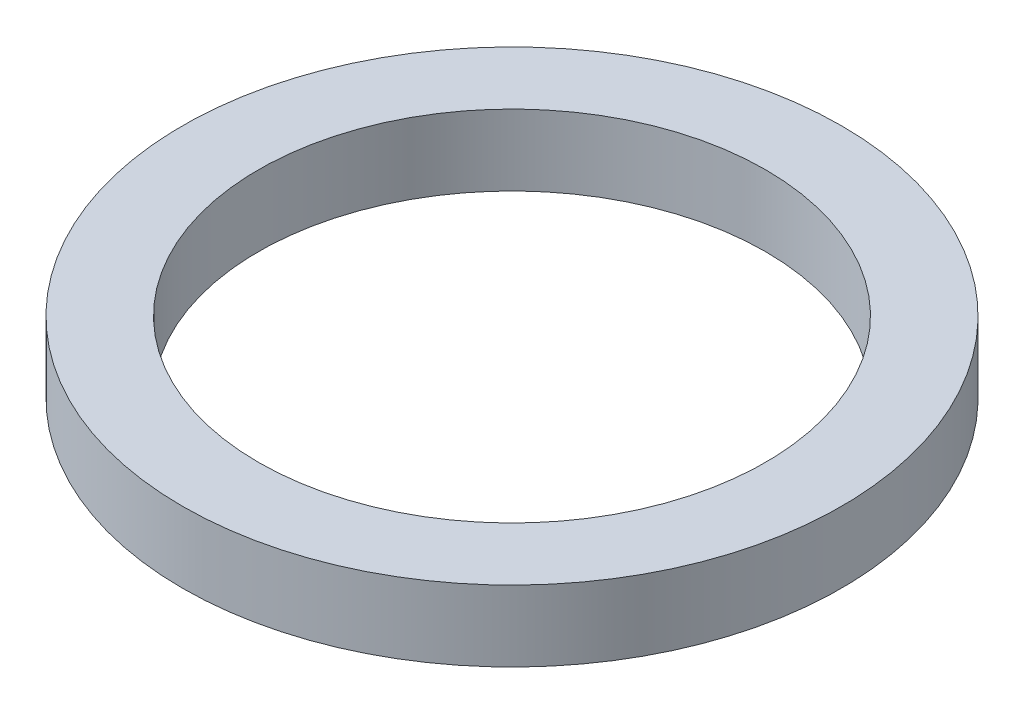
ISO-10303-21;
HEADER;
FILE_DESCRIPTION(('STEP AP214'),'2;1');
FILE_NAME('part.step','',(''),(''),'','','');
FILE_SCHEMA(('AUTOMOTIVE_DESIGN { 1 0 10303 214 1 1 1 1 }'));
ENDSEC;
DATA;
#1=APPLICATION_CONTEXT('core data for automotive mechanical design processes');
#2=APPLICATION_PROTOCOL_DEFINITION('international standard','automotive_design',2000,#1);
#3=PRODUCT_CONTEXT('',#1,'mechanical');
#4=PRODUCT('Part','Part','',(#3));
#5=PRODUCT_RELATED_PRODUCT_CATEGORY('part','',(#4));
#6=PRODUCT_DEFINITION_FORMATION('','',#4);
#7=PRODUCT_DEFINITION_CONTEXT('part definition',#1,'design');
#8=PRODUCT_DEFINITION('design','',#6,#7);
#9=PRODUCT_DEFINITION_SHAPE('','',#8);
#10=(LENGTH_UNIT() NAMED_UNIT(*) SI_UNIT(.MILLI.,.METRE.));
#11=(NAMED_UNIT(*) PLANE_ANGLE_UNIT() SI_UNIT($,.RADIAN.));
#12=(NAMED_UNIT(*) SI_UNIT($,.STERADIAN.) SOLID_ANGLE_UNIT());
#13=UNCERTAINTY_MEASURE_WITH_UNIT(LENGTH_MEASURE(1.E-05),#10,'distance_accuracy_value','');
#14=(GEOMETRIC_REPRESENTATION_CONTEXT(3) GLOBAL_UNCERTAINTY_ASSIGNED_CONTEXT((#13)) GLOBAL_UNIT_ASSIGNED_CONTEXT((#10,
#11,#12)) REPRESENTATION_CONTEXT('',''));
#15=CARTESIAN_POINT('',(0.,0.,0.));
#16=DIRECTION('',(0.,0.,1.));
#17=DIRECTION('',(1.,0.,0.));
#18=AXIS2_PLACEMENT_3D('',#15,#16,#17);
#19=CARTESIAN_POINT('',(0.,7.,0.));
#20=DIRECTION('',(0.,1.,0.));
#21=DIRECTION('',(0.,0.,1.));
#22=AXIS2_PLACEMENT_3D('',#19,#20,#21);
#23=PLANE('',#22);
#24=CARTESIAN_POINT('',(0.,7.,0.));
#25=DIRECTION('',(0.,1.,0.));
#26=DIRECTION('',(0.,0.,1.));
#27=AXIS2_PLACEMENT_3D('',#24,#25,#26);
#28=CIRCLE('',#27,32.5);
#29=CARTESIAN_POINT('',(0.,7.,32.5));
#30=VERTEX_POINT('',#29);
#31=EDGE_CURVE('E10',#30,#30,#28,.T.);
#32=ORIENTED_EDGE('',*,*,#31,.T.);
#33=EDGE_LOOP('',(#32));
#34=FACE_BOUND('',#33,.T.);
#35=CARTESIAN_POINT('',(0.,7.,0.));
#36=DIRECTION('',(0.,1.,0.));
#37=DIRECTION('',(0.,0.,1.));
#38=AXIS2_PLACEMENT_3D('',#35,#36,#37);
#39=CIRCLE('',#38,25.);
#40=CARTESIAN_POINT('',(0.,7.,25.));
#41=VERTEX_POINT('',#40);
#42=EDGE_CURVE('E42',#41,#41,#39,.T.);
#43=ORIENTED_EDGE('',*,*,#42,.F.);
#44=EDGE_LOOP('',(#43));
#45=FACE_BOUND('',#44,.T.);
#46=ADVANCED_FACE('F31',(#34,#45),#23,.T.);
#47=CARTESIAN_POINT('',(0.,0.,0.));
#48=DIRECTION('',(0.,1.,0.));
#49=DIRECTION('',(0.,0.,1.));
#50=AXIS2_PLACEMENT_3D('',#47,#48,#49);
#51=PLANE('',#50);
#52=CARTESIAN_POINT('',(0.,0.,0.));
#53=DIRECTION('',(0.,1.,0.));
#54=DIRECTION('',(0.,0.,1.));
#55=AXIS2_PLACEMENT_3D('',#52,#53,#54);
#56=CIRCLE('',#55,32.5);
#57=CARTESIAN_POINT('',(0.,0.,32.5));
#58=VERTEX_POINT('',#57);
#59=EDGE_CURVE('E35',#58,#58,#56,.T.);
#60=ORIENTED_EDGE('',*,*,#59,.F.);
#61=EDGE_LOOP('',(#60));
#62=FACE_BOUND('',#61,.T.);
#63=CARTESIAN_POINT('',(0.,0.,0.));
#64=DIRECTION('',(0.,1.,0.));
#65=DIRECTION('',(0.,0.,1.));
#66=AXIS2_PLACEMENT_3D('',#63,#64,#65);
#67=CIRCLE('',#66,25.);
#68=CARTESIAN_POINT('',(0.,0.,25.));
#69=VERTEX_POINT('',#68);
#70=EDGE_CURVE('E44',#69,#69,#67,.T.);
#71=ORIENTED_EDGE('',*,*,#70,.T.);
#72=EDGE_LOOP('',(#71));
#73=FACE_BOUND('',#72,.T.);
#74=ADVANCED_FACE('F54',(#62,#73),#51,.F.);
#75=CARTESIAN_POINT('',(0.,7.,0.));
#76=DIRECTION('',(0.,-1.,0.));
#77=DIRECTION('',(0.,0.,-1.));
#78=AXIS2_PLACEMENT_3D('',#75,#76,#77);
#79=CYLINDRICAL_SURFACE('',#78,32.5);
#80=ORIENTED_EDGE('',*,*,#31,.F.);
#81=EDGE_LOOP('',(#80));
#82=FACE_BOUND('',#81,.T.);
#83=ORIENTED_EDGE('',*,*,#59,.T.);
#84=EDGE_LOOP('',(#83));
#85=FACE_BOUND('',#84,.T.);
#86=ADVANCED_FACE('F33',(#82,#85),#79,.T.);
#87=CARTESIAN_POINT('',(0.,7.,0.));
#88=DIRECTION('',(0.,-1.,0.));
#89=DIRECTION('',(0.,0.,-1.));
#90=AXIS2_PLACEMENT_3D('',#87,#88,#89);
#91=CYLINDRICAL_SURFACE('',#90,25.);
#92=ORIENTED_EDGE('',*,*,#42,.T.);
#93=EDGE_LOOP('',(#92));
#94=FACE_BOUND('',#93,.T.);
#95=ORIENTED_EDGE('',*,*,#70,.F.);
#96=EDGE_LOOP('',(#95));
#97=FACE_BOUND('',#96,.T.);
#98=ADVANCED_FACE('F50',(#94,#97),#91,.F.);
#99=CLOSED_SHELL('',(#46,#74,#86,#98));
#100=MANIFOLD_SOLID_BREP('B2',#99);
#101=ADVANCED_BREP_SHAPE_REPRESENTATION('',(#18,#100),#14);
#102=SHAPE_DEFINITION_REPRESENTATION(#9,#101);
ENDSEC;
END-ISO-10303-21;
